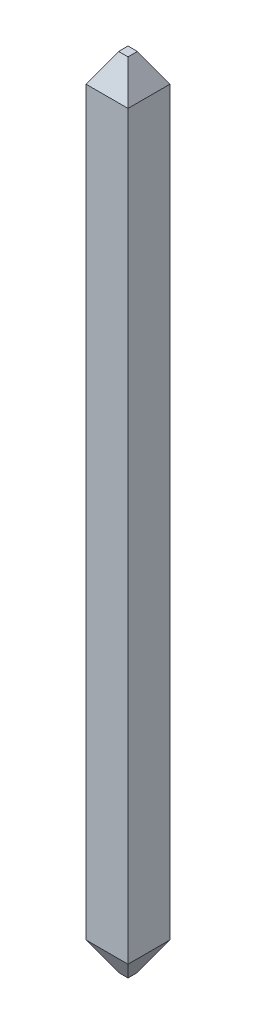
ISO-10303-21;
HEADER;
FILE_DESCRIPTION(('STEP AP214'),'2;1');
FILE_NAME('part.step','',(''),(''),'','','');
FILE_SCHEMA(('AUTOMOTIVE_DESIGN { 1 0 10303 214 1 1 1 1 }'));
ENDSEC;
DATA;
#1=APPLICATION_CONTEXT('core data for automotive mechanical design processes');
#2=APPLICATION_PROTOCOL_DEFINITION('international standard','automotive_design',2000,#1);
#3=PRODUCT_CONTEXT('',#1,'mechanical');
#4=PRODUCT('Part','Part','',(#3));
#5=PRODUCT_RELATED_PRODUCT_CATEGORY('part','',(#4));
#6=PRODUCT_DEFINITION_FORMATION('','',#4);
#7=PRODUCT_DEFINITION_CONTEXT('part definition',#1,'design');
#8=PRODUCT_DEFINITION('design','',#6,#7);
#9=PRODUCT_DEFINITION_SHAPE('','',#8);
#10=(LENGTH_UNIT() NAMED_UNIT(*) SI_UNIT(.MILLI.,.METRE.));
#11=(NAMED_UNIT(*) PLANE_ANGLE_UNIT() SI_UNIT($,.RADIAN.));
#12=(NAMED_UNIT(*) SI_UNIT($,.STERADIAN.) SOLID_ANGLE_UNIT());
#13=UNCERTAINTY_MEASURE_WITH_UNIT(LENGTH_MEASURE(1.E-05),#10,'distance_accuracy_value','');
#14=(GEOMETRIC_REPRESENTATION_CONTEXT(3) GLOBAL_UNCERTAINTY_ASSIGNED_CONTEXT((#13)) GLOBAL_UNIT_ASSIGNED_CONTEXT((#10,
#11,#12)) REPRESENTATION_CONTEXT('',''));
#15=CARTESIAN_POINT('',(0.,0.,0.));
#16=DIRECTION('',(0.,0.,1.));
#17=DIRECTION('',(1.,0.,0.));
#18=AXIS2_PLACEMENT_3D('',#15,#16,#17);
#19=CARTESIAN_POINT('',(-0.0749999999999993,12.7,0.));
#20=DIRECTION('',(-0.866025403784436,0.500000000000005,0.));
#21=DIRECTION('',(-0.500000000000005,-0.866025403784436,0.));
#22=AXIS2_PLACEMENT_3D('',#19,#20,#21);
#23=PLANE('',#22);
#24=DIRECTION('',(-0.447213595499962,-0.774596669241479,0.447213595499962));
#25=VECTOR('',#24,1.);
#26=CARTESIAN_POINT('',(-0.0749999999999993,12.7,0.0749999999999992));
#27=LINE('',#26,#25);
#28=CARTESIAN_POINT('',(-0.0749999999999993,12.7,0.0749999999999992));
#29=VERTEX_POINT('',#28);
#30=CARTESIAN_POINT('',(-0.335,12.2496667900321,0.335));
#31=VERTEX_POINT('',#30);
#32=EDGE_CURVE('E95',#29,#31,#27,.T.);
#33=ORIENTED_EDGE('',*,*,#32,.F.);
#34=DIRECTION('',(0.,0.,1.));
#35=VECTOR('',#34,1.);
#36=CARTESIAN_POINT('',(-0.0749999999999993,12.7,0.));
#37=LINE('',#36,#35);
#38=CARTESIAN_POINT('',(-0.0749999999999993,12.7,-0.0749999999999994));
#39=VERTEX_POINT('',#38);
#40=EDGE_CURVE('E19',#39,#29,#37,.T.);
#41=ORIENTED_EDGE('',*,*,#40,.F.);
#42=DIRECTION('',(0.447213595499962,0.774596669241479,0.447213595499962));
#43=VECTOR('',#42,1.);
#44=CARTESIAN_POINT('',(-0.335,12.2496667900321,-0.335));
#45=LINE('',#44,#43);
#46=CARTESIAN_POINT('',(-0.335,12.2496667900321,-0.335));
#47=VERTEX_POINT('',#46);
#48=EDGE_CURVE('E83',#47,#39,#45,.T.);
#49=ORIENTED_EDGE('',*,*,#48,.F.);
#50=DIRECTION('',(0.,0.,-1.));
#51=VECTOR('',#50,1.);
#52=CARTESIAN_POINT('',(-0.335,12.2496667900321,-0.335));
#53=LINE('',#52,#51);
#54=EDGE_CURVE('E119',#47,#31,#53,.F.);
#55=ORIENTED_EDGE('',*,*,#54,.T.);
#56=EDGE_LOOP('',(#33,#41,#49,#55));
#57=FACE_BOUND('',#56,.T.);
#58=ADVANCED_FACE('F16',(#57),#23,.T.);
#59=CARTESIAN_POINT('',(-0.335,0.45033320996791,-0.335));
#60=DIRECTION('',(0.866025403784439,0.499999999999999,0.));
#61=DIRECTION('',(-0.499999999999999,0.866025403784439,0.));
#62=AXIS2_PLACEMENT_3D('',#59,#60,#61);
#63=PLANE('',#62);
#64=DIRECTION('',(0.,0.,-1.));
#65=VECTOR('',#64,1.);
#66=CARTESIAN_POINT('',(-0.335,0.45033320996791,-0.335));
#67=LINE('',#66,#65);
#68=CARTESIAN_POINT('',(-0.335,0.45033320996791,0.335));
#69=VERTEX_POINT('',#68);
#70=CARTESIAN_POINT('',(-0.335,0.45033320996791,-0.335));
#71=VERTEX_POINT('',#70);
#72=EDGE_CURVE('E121',#69,#71,#67,.T.);
#73=ORIENTED_EDGE('',*,*,#72,.T.);
#74=DIRECTION('',(0.447213595499958,-0.774596669241484,0.447213595499957));
#75=VECTOR('',#74,1.);
#76=CARTESIAN_POINT('',(-0.335,0.45033320996791,-0.335));
#77=LINE('',#76,#75);
#78=CARTESIAN_POINT('',(-0.0749999999999993,0.,-0.0749999999999994));
#79=VERTEX_POINT('',#78);
#80=EDGE_CURVE('E77',#71,#79,#77,.T.);
#81=ORIENTED_EDGE('',*,*,#80,.T.);
#82=DIRECTION('',(0.,0.,1.));
#83=VECTOR('',#82,1.);
#84=CARTESIAN_POINT('',(-0.0749999999999993,0.,0.));
#85=LINE('',#84,#83);
#86=CARTESIAN_POINT('',(-0.0749999999999993,0.,0.0749999999999992));
#87=VERTEX_POINT('',#86);
#88=EDGE_CURVE('E108',#79,#87,#85,.T.);
#89=ORIENTED_EDGE('',*,*,#88,.T.);
#90=DIRECTION('',(-0.447213595499957,0.774596669241484,0.447213595499957));
#91=VECTOR('',#90,1.);
#92=CARTESIAN_POINT('',(-0.0749999999999993,0.,0.0749999999999992));
#93=LINE('',#92,#91);
#94=EDGE_CURVE('E116',#87,#69,#93,.T.);
#95=ORIENTED_EDGE('',*,*,#94,.T.);
#96=EDGE_LOOP('',(#73,#81,#89,#95));
#97=FACE_BOUND('',#96,.T.);
#98=ADVANCED_FACE('F212',(#97),#63,.F.);
#99=CARTESIAN_POINT('',(0.,12.7,0.));
#100=DIRECTION('',(0.,1.,0.));
#101=DIRECTION('',(0.,0.,1.));
#102=AXIS2_PLACEMENT_3D('',#99,#100,#101);
#103=PLANE('',#102);
#104=DIRECTION('',(0.,0.,1.));
#105=VECTOR('',#104,1.);
#106=CARTESIAN_POINT('',(0.0749999999999993,12.7,0.));
#107=LINE('',#106,#105);
#108=CARTESIAN_POINT('',(0.0749999999999993,12.7,-0.0749999999999994));
#109=VERTEX_POINT('',#108);
#110=CARTESIAN_POINT('',(0.0749999999999993,12.7,0.0749999999999992));
#111=VERTEX_POINT('',#110);
#112=EDGE_CURVE('E101',#109,#111,#107,.T.);
#113=ORIENTED_EDGE('',*,*,#112,.F.);
#114=DIRECTION('',(1.,0.,0.));
#115=VECTOR('',#114,1.);
#116=CARTESIAN_POINT('',(0.,12.7,-0.0749999999999994));
#117=LINE('',#116,#115);
#118=EDGE_CURVE('E88',#39,#109,#117,.T.);
#119=ORIENTED_EDGE('',*,*,#118,.F.);
#120=ORIENTED_EDGE('',*,*,#40,.T.);
#121=DIRECTION('',(1.,0.,0.));
#122=VECTOR('',#121,1.);
#123=CARTESIAN_POINT('',(0.,12.7,0.0749999999999992));
#124=LINE('',#123,#122);
#125=EDGE_CURVE('E111',#111,#29,#124,.F.);
#126=ORIENTED_EDGE('',*,*,#125,.F.);
#127=EDGE_LOOP('',(#113,#119,#120,#126));
#128=FACE_BOUND('',#127,.T.);
#129=ADVANCED_FACE('F100',(#128),#103,.T.);
#130=CARTESIAN_POINT('',(0.,12.7,-0.0749999999999994));
#131=DIRECTION('',(0.,0.500000000000005,-0.866025403784436));
#132=DIRECTION('',(0.,0.866025403784436,0.500000000000005));
#133=AXIS2_PLACEMENT_3D('',#130,#131,#132);
#134=PLANE('',#133);
#135=ORIENTED_EDGE('',*,*,#48,.T.);
#136=ORIENTED_EDGE('',*,*,#118,.T.);
#137=DIRECTION('',(-0.447213595499962,0.774596669241479,0.447213595499962));
#138=VECTOR('',#137,1.);
#139=CARTESIAN_POINT('',(0.335,12.2496667900321,-0.335));
#140=LINE('',#139,#138);
#141=CARTESIAN_POINT('',(0.335,12.2496667900321,-0.335));
#142=VERTEX_POINT('',#141);
#143=EDGE_CURVE('E123',#142,#109,#140,.T.);
#144=ORIENTED_EDGE('',*,*,#143,.F.);
#145=DIRECTION('',(1.,0.,0.));
#146=VECTOR('',#145,1.);
#147=CARTESIAN_POINT('',(-0.335,12.2496667900321,-0.335));
#148=LINE('',#147,#146);
#149=EDGE_CURVE('E90',#142,#47,#148,.F.);
#150=ORIENTED_EDGE('',*,*,#149,.T.);
#151=EDGE_LOOP('',(#135,#136,#144,#150));
#152=FACE_BOUND('',#151,.T.);
#153=ADVANCED_FACE('F85',(#152),#134,.T.);
#154=CARTESIAN_POINT('',(-0.335,0.45033320996791,-0.335));
#155=DIRECTION('',(0.,0.499999999999999,0.866025403784439));
#156=DIRECTION('',(0.,-0.866025403784439,0.499999999999999));
#157=AXIS2_PLACEMENT_3D('',#154,#155,#156);
#158=PLANE('',#157);
#159=DIRECTION('',(1.,0.,0.));
#160=VECTOR('',#159,1.);
#161=CARTESIAN_POINT('',(0.,0.,-0.0749999999999994));
#162=LINE('',#161,#160);
#163=CARTESIAN_POINT('',(0.0749999999999993,0.,-0.0749999999999994));
#164=VERTEX_POINT('',#163);
#165=EDGE_CURVE('E103',#164,#79,#162,.F.);
#166=ORIENTED_EDGE('',*,*,#165,.T.);
#167=ORIENTED_EDGE('',*,*,#80,.F.);
#168=DIRECTION('',(1.,0.,0.));
#169=VECTOR('',#168,1.);
#170=CARTESIAN_POINT('',(-0.335,0.45033320996791,-0.335));
#171=LINE('',#170,#169);
#172=CARTESIAN_POINT('',(0.335,0.45033320996791,-0.335));
#173=VERTEX_POINT('',#172);
#174=EDGE_CURVE('E132',#71,#173,#171,.T.);
#175=ORIENTED_EDGE('',*,*,#174,.T.);
#176=DIRECTION('',(-0.447213595499957,-0.774596669241484,0.447213595499957));
#177=VECTOR('',#176,1.);
#178=CARTESIAN_POINT('',(0.335,0.45033320996791,-0.335));
#179=LINE('',#178,#177);
#180=EDGE_CURVE('E135',#173,#164,#179,.T.);
#181=ORIENTED_EDGE('',*,*,#180,.T.);
#182=EDGE_LOOP('',(#166,#167,#175,#181));
#183=FACE_BOUND('',#182,.T.);
#184=ADVANCED_FACE('F204',(#183),#158,.F.);
#185=CARTESIAN_POINT('',(0.,0.,0.));
#186=DIRECTION('',(0.,1.,0.));
#187=DIRECTION('',(0.,0.,1.));
#188=AXIS2_PLACEMENT_3D('',#185,#186,#187);
#189=PLANE('',#188);
#190=ORIENTED_EDGE('',*,*,#165,.F.);
#191=DIRECTION('',(0.,0.,1.));
#192=VECTOR('',#191,1.);
#193=CARTESIAN_POINT('',(0.0749999999999992,0.,-0.335));
#194=LINE('',#193,#192);
#195=CARTESIAN_POINT('',(0.0749999999999993,0.,0.0749999999999992));
#196=VERTEX_POINT('',#195);
#197=EDGE_CURVE('E138',#164,#196,#194,.T.);
#198=ORIENTED_EDGE('',*,*,#197,.T.);
#199=DIRECTION('',(1.,0.,0.));
#200=VECTOR('',#199,1.);
#201=CARTESIAN_POINT('',(-0.335,0.,0.0749999999999992));
#202=LINE('',#201,#200);
#203=EDGE_CURVE('E113',#196,#87,#202,.F.);
#204=ORIENTED_EDGE('',*,*,#203,.T.);
#205=ORIENTED_EDGE('',*,*,#88,.F.);
#206=EDGE_LOOP('',(#190,#198,#204,#205));
#207=FACE_BOUND('',#206,.T.);
#208=ADVANCED_FACE('F201',(#207),#189,.F.);
#209=CARTESIAN_POINT('',(0.,12.7,0.0749999999999992));
#210=DIRECTION('',(0.,0.500000000000005,0.866025403784436));
#211=DIRECTION('',(0.,-0.866025403784436,0.500000000000005));
#212=AXIS2_PLACEMENT_3D('',#209,#210,#211);
#213=PLANE('',#212);
#214=DIRECTION('',(0.447213595499962,-0.774596669241479,0.447213595499962));
#215=VECTOR('',#214,1.);
#216=CARTESIAN_POINT('',(0.0749999999999993,12.7,0.0749999999999992));
#217=LINE('',#216,#215);
#218=CARTESIAN_POINT('',(0.335,12.2496667900321,0.335));
#219=VERTEX_POINT('',#218);
#220=EDGE_CURVE('E126',#111,#219,#217,.T.);
#221=ORIENTED_EDGE('',*,*,#220,.F.);
#222=ORIENTED_EDGE('',*,*,#125,.T.);
#223=ORIENTED_EDGE('',*,*,#32,.T.);
#224=DIRECTION('',(-1.,0.,0.));
#225=VECTOR('',#224,1.);
#226=CARTESIAN_POINT('',(-0.335,12.2496667900321,0.335));
#227=LINE('',#226,#225);
#228=EDGE_CURVE('E143',#31,#219,#227,.F.);
#229=ORIENTED_EDGE('',*,*,#228,.T.);
#230=EDGE_LOOP('',(#221,#222,#223,#229));
#231=FACE_BOUND('',#230,.T.);
#232=ADVANCED_FACE('F175',(#231),#213,.T.);
#233=CARTESIAN_POINT('',(-0.335,0.45033320996791,0.335));
#234=DIRECTION('',(0.,0.499999999999999,-0.866025403784439));
#235=DIRECTION('',(0.,0.866025403784439,0.499999999999999));
#236=AXIS2_PLACEMENT_3D('',#233,#234,#235);
#237=PLANE('',#236);
#238=ORIENTED_EDGE('',*,*,#203,.F.);
#239=DIRECTION('',(0.447213595499958,0.774596669241484,0.447213595499957));
#240=VECTOR('',#239,1.);
#241=CARTESIAN_POINT('',(0.0749999999999993,0.,0.0749999999999992));
#242=LINE('',#241,#240);
#243=CARTESIAN_POINT('',(0.335,0.45033320996791,0.335));
#244=VERTEX_POINT('',#243);
#245=EDGE_CURVE('E141',#196,#244,#242,.T.);
#246=ORIENTED_EDGE('',*,*,#245,.T.);
#247=DIRECTION('',(-1.,0.,0.));
#248=VECTOR('',#247,1.);
#249=CARTESIAN_POINT('',(-0.335,0.45033320996791,0.335));
#250=LINE('',#249,#248);
#251=EDGE_CURVE('E33',#244,#69,#250,.T.);
#252=ORIENTED_EDGE('',*,*,#251,.T.);
#253=ORIENTED_EDGE('',*,*,#94,.F.);
#254=EDGE_LOOP('',(#238,#246,#252,#253));
#255=FACE_BOUND('',#254,.T.);
#256=ADVANCED_FACE('F194',(#255),#237,.F.);
#257=CARTESIAN_POINT('',(-0.335,12.7,-0.335));
#258=DIRECTION('',(1.,0.,0.));
#259=DIRECTION('',(0.,0.,-1.));
#260=AXIS2_PLACEMENT_3D('',#257,#258,#259);
#261=PLANE('',#260);
#262=ORIENTED_EDGE('',*,*,#72,.F.);
#263=DIRECTION('',(0.,1.,0.));
#264=VECTOR('',#263,1.);
#265=CARTESIAN_POINT('',(-0.335,12.7,0.335));
#266=LINE('',#265,#264);
#267=EDGE_CURVE('E147',#69,#31,#266,.T.);
#268=ORIENTED_EDGE('',*,*,#267,.T.);
#269=ORIENTED_EDGE('',*,*,#54,.F.);
#270=DIRECTION('',(0.,1.,0.));
#271=VECTOR('',#270,1.);
#272=CARTESIAN_POINT('',(-0.335,12.7,-0.335));
#273=LINE('',#272,#271);
#274=EDGE_CURVE('E129',#47,#71,#273,.F.);
#275=ORIENTED_EDGE('',*,*,#274,.T.);
#276=EDGE_LOOP('',(#262,#268,#269,#275));
#277=FACE_BOUND('',#276,.T.);
#278=ADVANCED_FACE('F191',(#277),#261,.F.);
#279=CARTESIAN_POINT('',(0.0749999999999993,12.7,0.));
#280=DIRECTION('',(0.866025403784436,0.500000000000005,0.));
#281=DIRECTION('',(-0.500000000000005,0.866025403784436,0.));
#282=AXIS2_PLACEMENT_3D('',#279,#280,#281);
#283=PLANE('',#282);
#284=ORIENTED_EDGE('',*,*,#220,.T.);
#285=DIRECTION('',(0.,0.,1.));
#286=VECTOR('',#285,1.);
#287=CARTESIAN_POINT('',(0.335,12.2496667900321,-0.335));
#288=LINE('',#287,#286);
#289=EDGE_CURVE('E150',#219,#142,#288,.F.);
#290=ORIENTED_EDGE('',*,*,#289,.T.);
#291=ORIENTED_EDGE('',*,*,#143,.T.);
#292=ORIENTED_EDGE('',*,*,#112,.T.);
#293=EDGE_LOOP('',(#284,#290,#291,#292));
#294=FACE_BOUND('',#293,.T.);
#295=ADVANCED_FACE('F171',(#294),#283,.T.);
#296=CARTESIAN_POINT('',(-0.335,12.7,-0.335));
#297=DIRECTION('',(0.,0.,1.));
#298=DIRECTION('',(1.,0.,0.));
#299=AXIS2_PLACEMENT_3D('',#296,#297,#298);
#300=PLANE('',#299);
#301=ORIENTED_EDGE('',*,*,#174,.F.);
#302=ORIENTED_EDGE('',*,*,#274,.F.);
#303=ORIENTED_EDGE('',*,*,#149,.F.);
#304=DIRECTION('',(0.,1.,0.));
#305=VECTOR('',#304,1.);
#306=CARTESIAN_POINT('',(0.335,12.7,-0.335));
#307=LINE('',#306,#305);
#308=EDGE_CURVE('E153',#142,#173,#307,.F.);
#309=ORIENTED_EDGE('',*,*,#308,.T.);
#310=EDGE_LOOP('',(#301,#302,#303,#309));
#311=FACE_BOUND('',#310,.T.);
#312=ADVANCED_FACE('F169',(#311),#300,.F.);
#313=CARTESIAN_POINT('',(0.335,0.45033320996791,-0.335));
#314=DIRECTION('',(-0.866025403784439,0.499999999999999,0.));
#315=DIRECTION('',(-0.499999999999999,-0.866025403784439,0.));
#316=AXIS2_PLACEMENT_3D('',#313,#314,#315);
#317=PLANE('',#316);
#318=ORIENTED_EDGE('',*,*,#197,.F.);
#319=ORIENTED_EDGE('',*,*,#180,.F.);
#320=DIRECTION('',(0.,0.,1.));
#321=VECTOR('',#320,1.);
#322=CARTESIAN_POINT('',(0.335,0.45033320996791,-0.335));
#323=LINE('',#322,#321);
#324=EDGE_CURVE('E25',#173,#244,#323,.T.);
#325=ORIENTED_EDGE('',*,*,#324,.T.);
#326=ORIENTED_EDGE('',*,*,#245,.F.);
#327=EDGE_LOOP('',(#318,#319,#325,#326));
#328=FACE_BOUND('',#327,.T.);
#329=ADVANCED_FACE('F161',(#328),#317,.F.);
#330=CARTESIAN_POINT('',(-0.335,12.7,0.335));
#331=DIRECTION('',(0.,0.,-1.));
#332=DIRECTION('',(-1.,0.,0.));
#333=AXIS2_PLACEMENT_3D('',#330,#331,#332);
#334=PLANE('',#333);
#335=ORIENTED_EDGE('',*,*,#251,.F.);
#336=DIRECTION('',(0.,1.,0.));
#337=VECTOR('',#336,1.);
#338=CARTESIAN_POINT('',(0.335,12.7,0.335));
#339=LINE('',#338,#337);
#340=EDGE_CURVE('E10',#244,#219,#339,.T.);
#341=ORIENTED_EDGE('',*,*,#340,.T.);
#342=ORIENTED_EDGE('',*,*,#228,.F.);
#343=ORIENTED_EDGE('',*,*,#267,.F.);
#344=EDGE_LOOP('',(#335,#341,#342,#343));
#345=FACE_BOUND('',#344,.T.);
#346=ADVANCED_FACE('F176',(#345),#334,.F.);
#347=CARTESIAN_POINT('',(0.335,12.7,-0.335));
#348=DIRECTION('',(-1.,0.,0.));
#349=DIRECTION('',(0.,0.,1.));
#350=AXIS2_PLACEMENT_3D('',#347,#348,#349);
#351=PLANE('',#350);
#352=ORIENTED_EDGE('',*,*,#324,.F.);
#353=ORIENTED_EDGE('',*,*,#308,.F.);
#354=ORIENTED_EDGE('',*,*,#289,.F.);
#355=ORIENTED_EDGE('',*,*,#340,.F.);
#356=EDGE_LOOP('',(#352,#353,#354,#355));
#357=FACE_BOUND('',#356,.T.);
#358=ADVANCED_FACE('F165',(#357),#351,.F.);
#359=CLOSED_SHELL('',(#58,#98,#129,#153,#184,#208,#232,#256,#278,#295,#312,#329,#346,#358));
#360=MANIFOLD_SOLID_BREP('B1',#359);
#361=ADVANCED_BREP_SHAPE_REPRESENTATION('',(#18,#360),#14);
#362=SHAPE_DEFINITION_REPRESENTATION(#9,#361);
ENDSEC;
END-ISO-10303-21;
